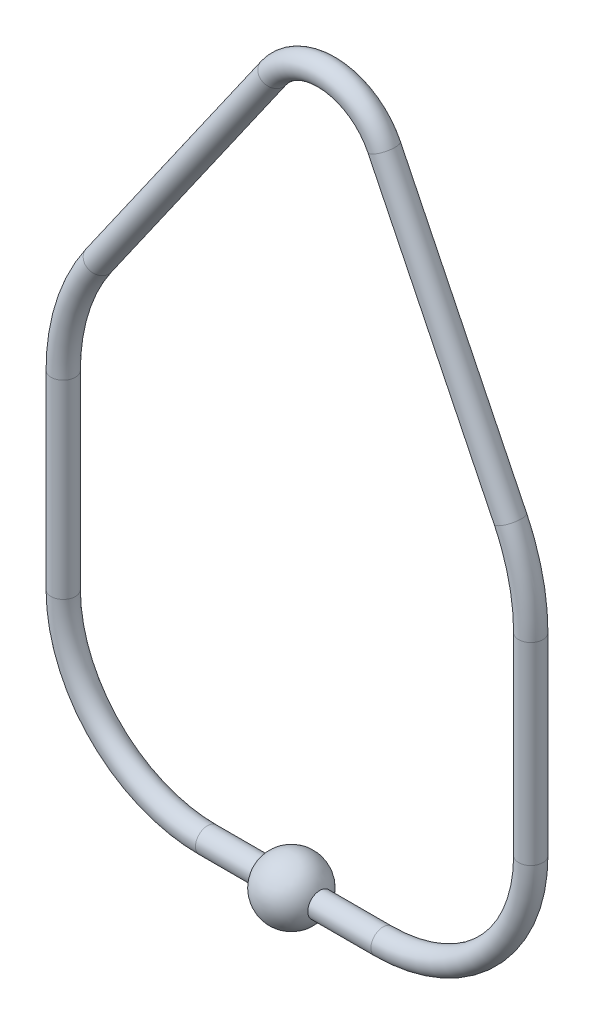
ISO-10303-21;
HEADER;
FILE_DESCRIPTION(('STEP AP214'),'2;1');
FILE_NAME('part.step','',(''),(''),'','','');
FILE_SCHEMA(('AUTOMOTIVE_DESIGN { 1 0 10303 214 1 1 1 1 }'));
ENDSEC;
DATA;
#1=APPLICATION_CONTEXT('core data for automotive mechanical design processes');
#2=APPLICATION_PROTOCOL_DEFINITION('international standard','automotive_design',2000,#1);
#3=PRODUCT_CONTEXT('',#1,'mechanical');
#4=PRODUCT('Part','Part','',(#3));
#5=PRODUCT_RELATED_PRODUCT_CATEGORY('part','',(#4));
#6=PRODUCT_DEFINITION_FORMATION('','',#4);
#7=PRODUCT_DEFINITION_CONTEXT('part definition',#1,'design');
#8=PRODUCT_DEFINITION('design','',#6,#7);
#9=PRODUCT_DEFINITION_SHAPE('','',#8);
#10=(LENGTH_UNIT() NAMED_UNIT(*) SI_UNIT(.MILLI.,.METRE.));
#11=(NAMED_UNIT(*) PLANE_ANGLE_UNIT() SI_UNIT($,.RADIAN.));
#12=(NAMED_UNIT(*) SI_UNIT($,.STERADIAN.) SOLID_ANGLE_UNIT());
#13=UNCERTAINTY_MEASURE_WITH_UNIT(LENGTH_MEASURE(1.E-05),#10,'distance_accuracy_value','');
#14=(GEOMETRIC_REPRESENTATION_CONTEXT(3) GLOBAL_UNCERTAINTY_ASSIGNED_CONTEXT((#13)) GLOBAL_UNIT_ASSIGNED_CONTEXT((#10,
#11,#12)) REPRESENTATION_CONTEXT('',''));
#15=CARTESIAN_POINT('',(0.,0.,0.));
#16=DIRECTION('',(0.,0.,1.));
#17=DIRECTION('',(1.,0.,0.));
#18=AXIS2_PLACEMENT_3D('',#15,#16,#17);
#19=CARTESIAN_POINT('',(-13.6219017243065,-33.3971041858877,13.9987554756163));
#20=DIRECTION('',(1.,0.,0.));
#21=DIRECTION('',(0.,1.,0.));
#22=AXIS2_PLACEMENT_3D('',#19,#20,#21);
#23=CYLINDRICAL_SURFACE('',#22,2.);
#24=CARTESIAN_POINT('',(4.86957991798951,-33.3971041858877,13.9987554756163));
#25=DIRECTION('',(1.,0.,0.));
#26=DIRECTION('',(0.,1.,0.));
#27=AXIS2_PLACEMENT_3D('',#24,#25,#26);
#28=CIRCLE('',#27,2.);
#29=CARTESIAN_POINT('',(4.86957991798951,-31.3971041858877,13.9987554756163));
#30=VERTEX_POINT('',#29);
#31=EDGE_CURVE('E20',#30,#30,#28,.F.);
#32=ORIENTED_EDGE('',*,*,#31,.F.);
#33=EDGE_LOOP('',(#32));
#34=FACE_BOUND('',#33,.T.);
#35=CARTESIAN_POINT('',(15.2737665469708,-33.3971041858876,13.9987554756163));
#36=DIRECTION('',(1.,0.,0.));
#37=DIRECTION('',(0.,-1.,0.));
#38=AXIS2_PLACEMENT_3D('',#35,#36,#37);
#39=CIRCLE('',#38,2.);
#40=CARTESIAN_POINT('',(15.2737665469708,-35.3971041858876,13.9987554756163));
#41=VERTEX_POINT('',#40);
#42=EDGE_CURVE('E49',#41,#41,#39,.T.);
#43=ORIENTED_EDGE('',*,*,#42,.F.);
#44=EDGE_LOOP('',(#43));
#45=FACE_BOUND('',#44,.T.);
#46=ADVANCED_FACE('F17',(#34,#45),#23,.T.);
#47=CARTESIAN_POINT('',(15.2737665469708,-9.07087073285845,13.9987554756163));
#48=DIRECTION('',(0.,0.,1.));
#49=DIRECTION('',(0.,-1.,0.));
#50=AXIS2_PLACEMENT_3D('',#47,#48,#49);
#51=TOROIDAL_SURFACE('',#50,24.3262334530292,2.);
#52=ORIENTED_EDGE('',*,*,#42,.T.);
#53=EDGE_LOOP('',(#52));
#54=FACE_BOUND('',#53,.T.);
#55=CARTESIAN_POINT('',(39.6,-9.07087073285844,13.9987554756163));
#56=DIRECTION('',(0.,1.,0.));
#57=DIRECTION('',(-1.,0.,0.));
#58=AXIS2_PLACEMENT_3D('',#55,#56,#57);
#59=CIRCLE('',#58,2.);
#60=CARTESIAN_POINT('',(37.6,-9.07087073285844,13.9987554756163));
#61=VERTEX_POINT('',#60);
#62=EDGE_CURVE('E48',#61,#61,#59,.T.);
#63=ORIENTED_EDGE('',*,*,#62,.F.);
#64=EDGE_LOOP('',(#63));
#65=FACE_BOUND('',#64,.T.);
#66=ADVANCED_FACE('F39',(#54,#65),#51,.T.);
#67=CARTESIAN_POINT('',(0.178098275693543,-33.3971041858877,13.9987554756163));
#68=DIRECTION('',(0.,1.,0.));
#69=DIRECTION('',(0.,0.,1.));
#70=AXIS2_PLACEMENT_3D('',#67,#68,#69);
#71=SPHERICAL_SURFACE('',#70,5.1);
#72=CARTESIAN_POINT('',(0.178098275693548,-28.2971041858877,13.9987554756163));
#73=VERTEX_POINT('',#72);
#74=VERTEX_LOOP('',#73);
#75=FACE_BOUND('',#74,.T.);
#76=CARTESIAN_POINT('',(-4.51338336660242,-33.3971041858877,13.9987554756163));
#77=DIRECTION('',(1.,0.,0.));
#78=DIRECTION('',(0.,1.,0.));
#79=AXIS2_PLACEMENT_3D('',#76,#77,#78);
#80=CIRCLE('',#79,2.);
#81=CARTESIAN_POINT('',(-4.51338336660242,-31.3971041858877,13.9987554756163));
#82=VERTEX_POINT('',#81);
#83=EDGE_CURVE('E43',#82,#82,#80,.F.);
#84=ORIENTED_EDGE('',*,*,#83,.F.);
#85=EDGE_LOOP('',(#84));
#86=FACE_BOUND('',#85,.T.);
#87=CARTESIAN_POINT('',(0.178098275693538,-38.4971041858877,13.9987554756163));
#88=VERTEX_POINT('',#87);
#89=VERTEX_LOOP('',#88);
#90=FACE_BOUND('',#89,.T.);
#91=ORIENTED_EDGE('',*,*,#31,.T.);
#92=EDGE_LOOP('',(#91));
#93=FACE_BOUND('',#92,.T.);
#94=ADVANCED_FACE('F35',(#75,#86,#90,#93),#71,.T.);
#95=CARTESIAN_POINT('',(39.6,-9.07087073285844,13.9987554756163));
#96=DIRECTION('',(0.,1.,0.));
#97=DIRECTION('',(-1.,0.,0.));
#98=AXIS2_PLACEMENT_3D('',#95,#96,#97);
#99=CYLINDRICAL_SURFACE('',#98,2.);
#100=ORIENTED_EDGE('',*,*,#62,.T.);
#101=EDGE_LOOP('',(#100));
#102=FACE_BOUND('',#101,.T.);
#103=CARTESIAN_POINT('',(39.6,22.7319831399686,13.9987554756163));
#104=DIRECTION('',(0.,1.,0.));
#105=DIRECTION('',(1.,0.,0.));
#106=AXIS2_PLACEMENT_3D('',#103,#104,#105);
#107=CIRCLE('',#106,2.);
#108=CARTESIAN_POINT('',(41.6,22.7319831399686,13.9987554756163));
#109=VERTEX_POINT('',#108);
#110=EDGE_CURVE('E64',#109,#109,#107,.T.);
#111=ORIENTED_EDGE('',*,*,#110,.F.);
#112=EDGE_LOOP('',(#111));
#113=FACE_BOUND('',#112,.T.);
#114=ADVANCED_FACE('F38',(#102,#113),#99,.T.);
#115=CARTESIAN_POINT('',(-13.6219017243065,-33.3971041858877,13.9987554756163));
#116=DIRECTION('',(1.,0.,0.));
#117=DIRECTION('',(0.,1.,0.));
#118=AXIS2_PLACEMENT_3D('',#115,#116,#117);
#119=CYLINDRICAL_SURFACE('',#118,2.);
#120=CARTESIAN_POINT('',(-13.6219017243065,-33.3971041858877,13.9987554756163));
#121=DIRECTION('',(1.,0.,0.));
#122=DIRECTION('',(0.,-1.,0.));
#123=AXIS2_PLACEMENT_3D('',#120,#121,#122);
#124=CIRCLE('',#123,2.);
#125=CARTESIAN_POINT('',(-13.6219017243065,-35.3971041858877,13.9987554756163));
#126=VERTEX_POINT('',#125);
#127=EDGE_CURVE('E69',#126,#126,#124,.F.);
#128=ORIENTED_EDGE('',*,*,#127,.F.);
#129=EDGE_LOOP('',(#128));
#130=FACE_BOUND('',#129,.T.);
#131=ORIENTED_EDGE('',*,*,#83,.T.);
#132=EDGE_LOOP('',(#131));
#133=FACE_BOUND('',#132,.T.);
#134=ADVANCED_FACE('F131',(#130,#133),#119,.T.);
#135=CARTESIAN_POINT('',(6.37889114808696,22.7319831399686,13.9987554756163));
#136=DIRECTION('',(0.,0.,1.));
#137=DIRECTION('',(1.,0.,0.));
#138=AXIS2_PLACEMENT_3D('',#135,#136,#137);
#139=TOROIDAL_SURFACE('',#138,33.221108851913,2.);
#140=ORIENTED_EDGE('',*,*,#110,.T.);
#141=EDGE_LOOP('',(#140));
#142=FACE_BOUND('',#141,.T.);
#143=CARTESIAN_POINT('',(36.2378259956429,37.2951587249865,13.9987554756163));
#144=DIRECTION('',(-0.438371146789078,0.898794046299167,0.));
#145=DIRECTION('',(-0.898794046299167,-0.438371146789078,0.));
#146=AXIS2_PLACEMENT_3D('',#143,#144,#145);
#147=CIRCLE('',#146,2.);
#148=CARTESIAN_POINT('',(34.4402379030446,36.4184164314084,13.9987554756163));
#149=VERTEX_POINT('',#148);
#150=EDGE_CURVE('E74',#149,#149,#147,.T.);
#151=ORIENTED_EDGE('',*,*,#150,.F.);
#152=EDGE_LOOP('',(#151));
#153=FACE_BOUND('',#152,.T.);
#154=ADVANCED_FACE('F128',(#142,#153),#139,.T.);
#155=CARTESIAN_POINT('',(-13.6219017243065,-9.6190059101941,13.9987554756163));
#156=DIRECTION('',(0.,0.,1.));
#157=DIRECTION('',(-1.,0.,0.));
#158=AXIS2_PLACEMENT_3D('',#155,#156,#157);
#159=TOROIDAL_SURFACE('',#158,23.7780982756936,2.);
#160=CARTESIAN_POINT('',(-37.4,-9.61900591019413,13.9987554756163));
#161=DIRECTION('',(0.,-1.,0.));
#162=DIRECTION('',(1.,0.,0.));
#163=AXIS2_PLACEMENT_3D('',#160,#161,#162);
#164=CIRCLE('',#163,2.);
#165=CARTESIAN_POINT('',(-35.4,-9.61900591019413,13.9987554756163));
#166=VERTEX_POINT('',#165);
#167=EDGE_CURVE('E116',#166,#166,#164,.F.);
#168=ORIENTED_EDGE('',*,*,#167,.F.);
#169=EDGE_LOOP('',(#168));
#170=FACE_BOUND('',#169,.T.);
#171=ORIENTED_EDGE('',*,*,#127,.T.);
#172=EDGE_LOOP('',(#171));
#173=FACE_BOUND('',#172,.T.);
#174=ADVANCED_FACE('F123',(#170,#173),#159,.T.);
#175=CARTESIAN_POINT('',(36.2378259956429,37.2951587249865,13.9987554756163));
#176=DIRECTION('',(-0.438371146789078,0.898794046299167,0.));
#177=DIRECTION('',(-0.898794046299167,-0.438371146789078,0.));
#178=AXIS2_PLACEMENT_3D('',#175,#176,#177);
#179=CYLINDRICAL_SURFACE('',#178,2.);
#180=ORIENTED_EDGE('',*,*,#150,.T.);
#181=EDGE_LOOP('',(#180));
#182=FACE_BOUND('',#181,.T.);
#183=CARTESIAN_POINT('',(15.4567337746209,79.9027119379615,13.9987554756163));
#184=DIRECTION('',(-0.438371146789078,0.898794046299167,0.));
#185=DIRECTION('',(0.898794046299166,0.43837114678908,0.));
#186=AXIS2_PLACEMENT_3D('',#183,#184,#185);
#187=CIRCLE('',#186,2.);
#188=CARTESIAN_POINT('',(17.2543218672193,80.7794542315396,13.9987554756163));
#189=VERTEX_POINT('',#188);
#190=EDGE_CURVE('E110',#189,#189,#187,.T.);
#191=ORIENTED_EDGE('',*,*,#190,.F.);
#192=EDGE_LOOP('',(#191));
#193=FACE_BOUND('',#192,.T.);
#194=ADVANCED_FACE('F127',(#182,#193),#179,.T.);
#195=CARTESIAN_POINT('',(-37.4,21.6476142165048,13.9987554756163));
#196=DIRECTION('',(0.,-1.,0.));
#197=DIRECTION('',(1.,0.,0.));
#198=AXIS2_PLACEMENT_3D('',#195,#196,#197);
#199=CYLINDRICAL_SURFACE('',#198,2.);
#200=CARTESIAN_POINT('',(-37.4,21.6476142165048,13.9987554756163));
#201=DIRECTION('',(0.,-1.,0.));
#202=DIRECTION('',(-1.,0.,0.));
#203=AXIS2_PLACEMENT_3D('',#200,#201,#202);
#204=CIRCLE('',#203,2.);
#205=CARTESIAN_POINT('',(-39.4000000000001,21.6476142165048,13.9987554756163));
#206=VERTEX_POINT('',#205);
#207=EDGE_CURVE('E108',#206,#206,#204,.F.);
#208=ORIENTED_EDGE('',*,*,#207,.F.);
#209=EDGE_LOOP('',(#208));
#210=FACE_BOUND('',#209,.T.);
#211=ORIENTED_EDGE('',*,*,#167,.T.);
#212=EDGE_LOOP('',(#211));
#213=FACE_BOUND('',#212,.T.);
#214=ADVANCED_FACE('F189',(#210,#213),#199,.T.);
#215=CARTESIAN_POINT('',(5.91745056507429,75.2500926451064,13.9987554756163));
#216=DIRECTION('',(0.,0.,1.));
#217=DIRECTION('',(0.898794046299167,0.438371146789078,0.));
#218=AXIS2_PLACEMENT_3D('',#215,#216,#217);
#219=TOROIDAL_SURFACE('',#218,10.613425009684,2.);
#220=ORIENTED_EDGE('',*,*,#190,.T.);
#221=EDGE_LOOP('',(#220));
#222=FACE_BOUND('',#221,.T.);
#223=CARTESIAN_POINT('',(-2.77655822851628,81.3377031396401,13.9987554756163));
#224=DIRECTION('',(-0.573576436351047,-0.819152044288991,0.));
#225=DIRECTION('',(0.819152044288991,-0.573576436351047,0.));
#226=AXIS2_PLACEMENT_3D('',#223,#224,#225);
#227=CIRCLE('',#226,2.);
#228=CARTESIAN_POINT('',(-1.13825413993829,80.190550266938,13.9987554756163));
#229=VERTEX_POINT('',#228);
#230=EDGE_CURVE('E26',#229,#229,#227,.T.);
#231=ORIENTED_EDGE('',*,*,#230,.F.);
#232=EDGE_LOOP('',(#231));
#233=FACE_BOUND('',#232,.T.);
#234=ADVANCED_FACE('F96',(#222,#233),#219,.T.);
#235=CARTESIAN_POINT('',(-4.91433899554125,21.6476142165048,13.9987554756163));
#236=DIRECTION('',(0.,0.,1.));
#237=DIRECTION('',(-0.819152044288992,0.573576436351045,0.));
#238=AXIS2_PLACEMENT_3D('',#235,#236,#237);
#239=TOROIDAL_SURFACE('',#238,32.4856610044588,2.);
#240=CARTESIAN_POINT('',(-31.5250346174229,40.2806238879504,13.9987554756163));
#241=DIRECTION('',(-0.573576436351047,-0.819152044288991,0.));
#242=DIRECTION('',(0.819152044288991,-0.573576436351047,0.));
#243=AXIS2_PLACEMENT_3D('',#240,#241,#242);
#244=CIRCLE('',#243,2.);
#245=CARTESIAN_POINT('',(-29.886730528845,39.1334710152483,13.9987554756163));
#246=VERTEX_POINT('',#245);
#247=EDGE_CURVE('E11',#246,#246,#244,.F.);
#248=ORIENTED_EDGE('',*,*,#247,.F.);
#249=EDGE_LOOP('',(#248));
#250=FACE_BOUND('',#249,.T.);
#251=ORIENTED_EDGE('',*,*,#207,.T.);
#252=EDGE_LOOP('',(#251));
#253=FACE_BOUND('',#252,.T.);
#254=ADVANCED_FACE('F90',(#250,#253),#239,.T.);
#255=CARTESIAN_POINT('',(-2.77655822851628,81.3377031396401,13.9987554756163));
#256=DIRECTION('',(-0.573576436351047,-0.819152044288991,0.));
#257=DIRECTION('',(0.819152044288991,-0.573576436351047,0.));
#258=AXIS2_PLACEMENT_3D('',#255,#256,#257);
#259=CYLINDRICAL_SURFACE('',#258,2.);
#260=ORIENTED_EDGE('',*,*,#230,.T.);
#261=EDGE_LOOP('',(#260));
#262=FACE_BOUND('',#261,.T.);
#263=ORIENTED_EDGE('',*,*,#247,.T.);
#264=EDGE_LOOP('',(#263));
#265=FACE_BOUND('',#264,.T.);
#266=ADVANCED_FACE('F88',(#262,#265),#259,.T.);
#267=CLOSED_SHELL('',(#46,#66,#94,#114,#134,#154,#174,#194,#214,#234,#254,#266));
#268=MANIFOLD_SOLID_BREP('B1',#267);
#269=ADVANCED_BREP_SHAPE_REPRESENTATION('',(#18,#268),#14);
#270=SHAPE_DEFINITION_REPRESENTATION(#9,#269);
ENDSEC;
END-ISO-10303-21;
